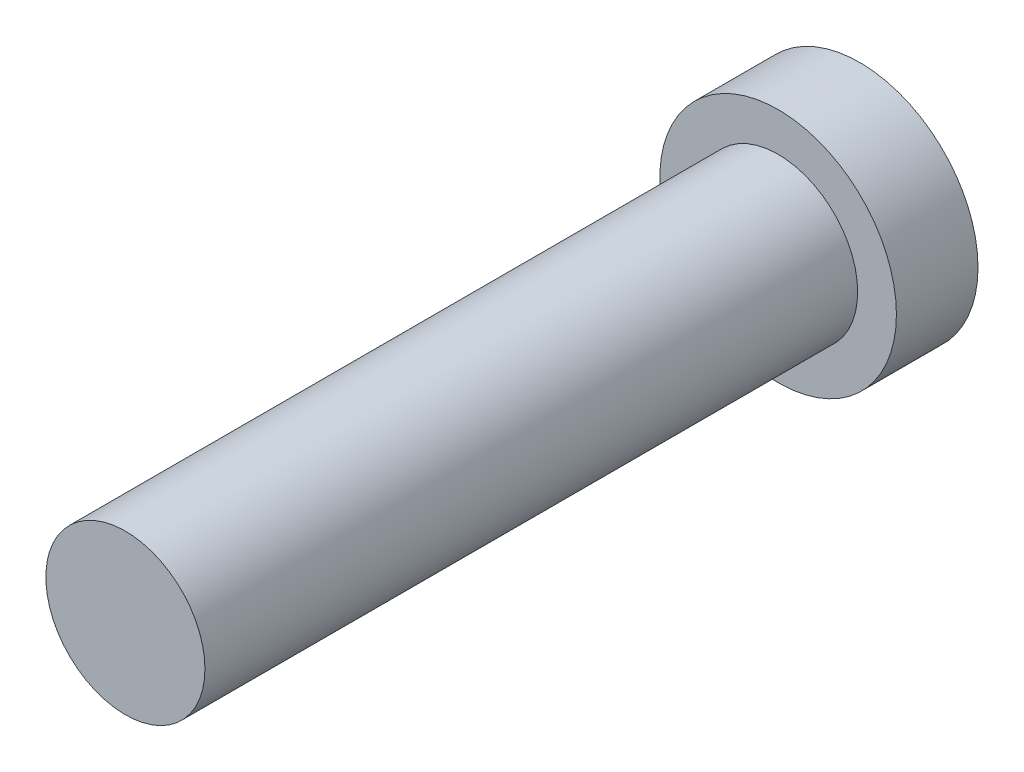
ISO-10303-21;
HEADER;
FILE_DESCRIPTION(('STEP AP214'),'2;1');
FILE_NAME('part.step','',(''),(''),'','','');
FILE_SCHEMA(('AUTOMOTIVE_DESIGN { 1 0 10303 214 1 1 1 1 }'));
ENDSEC;
DATA;
#1=APPLICATION_CONTEXT('core data for automotive mechanical design processes');
#2=APPLICATION_PROTOCOL_DEFINITION('international standard','automotive_design',2000,#1);
#3=PRODUCT_CONTEXT('',#1,'mechanical');
#4=PRODUCT('Part','Part','',(#3));
#5=PRODUCT_RELATED_PRODUCT_CATEGORY('part','',(#4));
#6=PRODUCT_DEFINITION_FORMATION('','',#4);
#7=PRODUCT_DEFINITION_CONTEXT('part definition',#1,'design');
#8=PRODUCT_DEFINITION('design','',#6,#7);
#9=PRODUCT_DEFINITION_SHAPE('','',#8);
#10=(LENGTH_UNIT() NAMED_UNIT(*) SI_UNIT(.MILLI.,.METRE.));
#11=(NAMED_UNIT(*) PLANE_ANGLE_UNIT() SI_UNIT($,.RADIAN.));
#12=(NAMED_UNIT(*) SI_UNIT($,.STERADIAN.) SOLID_ANGLE_UNIT());
#13=UNCERTAINTY_MEASURE_WITH_UNIT(LENGTH_MEASURE(1.E-05),#10,'distance_accuracy_value','');
#14=(GEOMETRIC_REPRESENTATION_CONTEXT(3) GLOBAL_UNCERTAINTY_ASSIGNED_CONTEXT((#13)) GLOBAL_UNIT_ASSIGNED_CONTEXT((#10,
#11,#12)) REPRESENTATION_CONTEXT('',''));
#15=CARTESIAN_POINT('',(0.,0.,0.));
#16=DIRECTION('',(0.,0.,1.));
#17=DIRECTION('',(1.,0.,0.));
#18=AXIS2_PLACEMENT_3D('',#15,#16,#17);
#19=CARTESIAN_POINT('',(0.,0.,2.));
#20=DIRECTION('',(0.,0.,-1.));
#21=DIRECTION('',(-1.,0.,0.));
#22=AXIS2_PLACEMENT_3D('',#19,#20,#21);
#23=CYLINDRICAL_SURFACE('',#22,2.9);
#24=CARTESIAN_POINT('',(0.,0.,2.));
#25=DIRECTION('',(0.,0.,1.));
#26=DIRECTION('',(1.,0.,0.));
#27=AXIS2_PLACEMENT_3D('',#24,#25,#26);
#28=CIRCLE('',#27,2.9);
#29=CARTESIAN_POINT('',(2.9,0.,2.));
#30=VERTEX_POINT('',#29);
#31=EDGE_CURVE('E45',#30,#30,#28,.T.);
#32=ORIENTED_EDGE('',*,*,#31,.F.);
#33=EDGE_LOOP('',(#32));
#34=FACE_BOUND('',#33,.T.);
#35=CARTESIAN_POINT('',(0.,0.,0.));
#36=DIRECTION('',(0.,0.,1.));
#37=DIRECTION('',(1.,0.,0.));
#38=AXIS2_PLACEMENT_3D('',#35,#36,#37);
#39=CIRCLE('',#38,2.9);
#40=CARTESIAN_POINT('',(2.9,0.,0.));
#41=VERTEX_POINT('',#40);
#42=EDGE_CURVE('E40',#41,#41,#39,.T.);
#43=ORIENTED_EDGE('',*,*,#42,.T.);
#44=EDGE_LOOP('',(#43));
#45=FACE_BOUND('',#44,.T.);
#46=ADVANCED_FACE('F37',(#34,#45),#23,.T.);
#47=CARTESIAN_POINT('',(0.,0.,2.));
#48=DIRECTION('',(0.,0.,1.));
#49=DIRECTION('',(1.,0.,0.));
#50=AXIS2_PLACEMENT_3D('',#47,#48,#49);
#51=PLANE('',#50);
#52=CARTESIAN_POINT('',(0.,0.,2.));
#53=DIRECTION('',(0.,0.,1.));
#54=DIRECTION('',(1.,0.,0.));
#55=AXIS2_PLACEMENT_3D('',#52,#53,#54);
#56=CIRCLE('',#55,1.95);
#57=CARTESIAN_POINT('',(1.95,0.,2.));
#58=VERTEX_POINT('',#57);
#59=EDGE_CURVE('E10',#58,#58,#56,.T.);
#60=ORIENTED_EDGE('',*,*,#59,.F.);
#61=EDGE_LOOP('',(#60));
#62=FACE_BOUND('',#61,.T.);
#63=ORIENTED_EDGE('',*,*,#31,.T.);
#64=EDGE_LOOP('',(#63));
#65=FACE_BOUND('',#64,.T.);
#66=ADVANCED_FACE('F65',(#62,#65),#51,.T.);
#67=CARTESIAN_POINT('',(0.,0.,0.));
#68=DIRECTION('',(0.,0.,1.));
#69=DIRECTION('',(1.,0.,0.));
#70=AXIS2_PLACEMENT_3D('',#67,#68,#69);
#71=PLANE('',#70);
#72=ORIENTED_EDGE('',*,*,#42,.F.);
#73=EDGE_LOOP('',(#72));
#74=FACE_BOUND('',#73,.T.);
#75=ADVANCED_FACE('F62',(#74),#71,.F.);
#76=CARTESIAN_POINT('',(0.,0.,18.));
#77=DIRECTION('',(0.,0.,-1.));
#78=DIRECTION('',(-1.,0.,0.));
#79=AXIS2_PLACEMENT_3D('',#76,#77,#78);
#80=CYLINDRICAL_SURFACE('',#79,1.95);
#81=CARTESIAN_POINT('',(0.,0.,18.));
#82=DIRECTION('',(0.,0.,1.));
#83=DIRECTION('',(1.,0.,0.));
#84=AXIS2_PLACEMENT_3D('',#81,#82,#83);
#85=CIRCLE('',#84,1.95);
#86=CARTESIAN_POINT('',(1.95,0.,18.));
#87=VERTEX_POINT('',#86);
#88=EDGE_CURVE('E52',#87,#87,#85,.T.);
#89=ORIENTED_EDGE('',*,*,#88,.F.);
#90=EDGE_LOOP('',(#89));
#91=FACE_BOUND('',#90,.T.);
#92=ORIENTED_EDGE('',*,*,#59,.T.);
#93=EDGE_LOOP('',(#92));
#94=FACE_BOUND('',#93,.T.);
#95=ADVANCED_FACE('F64',(#91,#94),#80,.T.);
#96=CARTESIAN_POINT('',(0.,0.,18.));
#97=DIRECTION('',(0.,0.,1.));
#98=DIRECTION('',(1.,0.,0.));
#99=AXIS2_PLACEMENT_3D('',#96,#97,#98);
#100=PLANE('',#99);
#101=ORIENTED_EDGE('',*,*,#88,.T.);
#102=EDGE_LOOP('',(#101));
#103=FACE_BOUND('',#102,.T.);
#104=ADVANCED_FACE('F70',(#103),#100,.T.);
#105=CLOSED_SHELL('',(#46,#66,#75,#95,#104));
#106=MANIFOLD_SOLID_BREP('B2',#105);
#107=ADVANCED_BREP_SHAPE_REPRESENTATION('',(#18,#106),#14);
#108=SHAPE_DEFINITION_REPRESENTATION(#9,#107);
ENDSEC;
END-ISO-10303-21;
